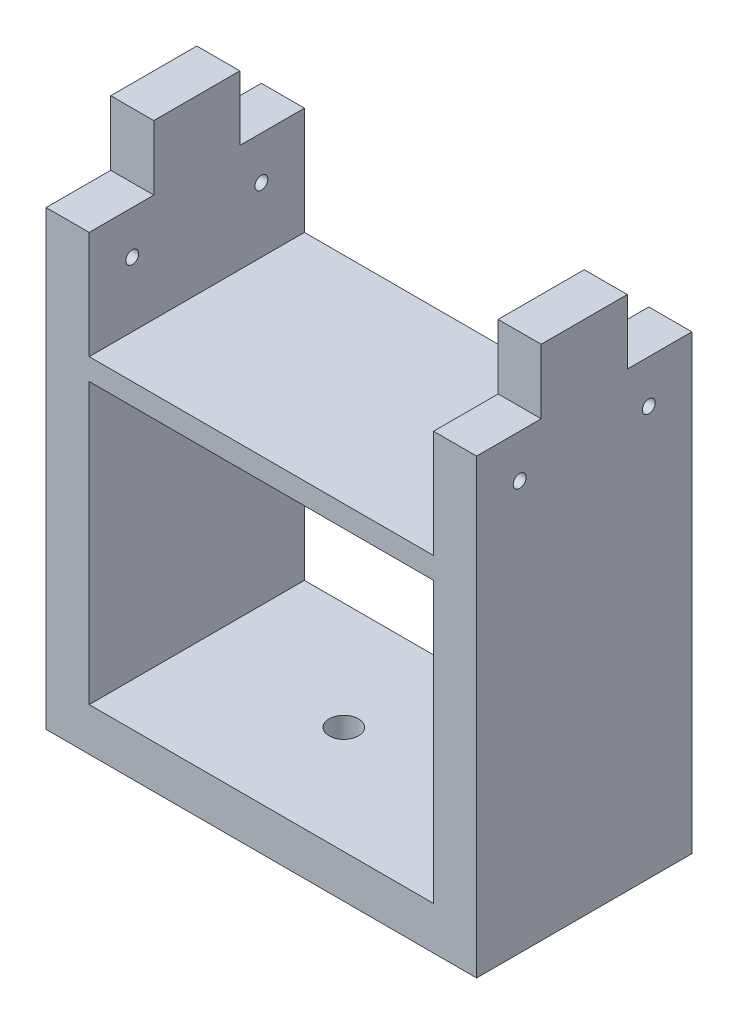
ISO-10303-21;
HEADER;
FILE_DESCRIPTION(('STEP AP214'),'2;1');
FILE_NAME('part.step','',(''),(''),'','','');
FILE_SCHEMA(('AUTOMOTIVE_DESIGN { 1 0 10303 214 1 1 1 1 }'));
ENDSEC;
DATA;
#1=APPLICATION_CONTEXT('core data for automotive mechanical design processes');
#2=APPLICATION_PROTOCOL_DEFINITION('international standard','automotive_design',2000,#1);
#3=PRODUCT_CONTEXT('',#1,'mechanical');
#4=PRODUCT('Part','Part','',(#3));
#5=PRODUCT_RELATED_PRODUCT_CATEGORY('part','',(#4));
#6=PRODUCT_DEFINITION_FORMATION('','',#4);
#7=PRODUCT_DEFINITION_CONTEXT('part definition',#1,'design');
#8=PRODUCT_DEFINITION('design','',#6,#7);
#9=PRODUCT_DEFINITION_SHAPE('','',#8);
#10=(LENGTH_UNIT() NAMED_UNIT(*) SI_UNIT(.MILLI.,.METRE.));
#11=(NAMED_UNIT(*) PLANE_ANGLE_UNIT() SI_UNIT($,.RADIAN.));
#12=(NAMED_UNIT(*) SI_UNIT($,.STERADIAN.) SOLID_ANGLE_UNIT());
#13=UNCERTAINTY_MEASURE_WITH_UNIT(LENGTH_MEASURE(1.E-05),#10,'distance_accuracy_value','');
#14=(GEOMETRIC_REPRESENTATION_CONTEXT(3) GLOBAL_UNCERTAINTY_ASSIGNED_CONTEXT((#13)) GLOBAL_UNIT_ASSIGNED_CONTEXT((#10,
#11,#12)) REPRESENTATION_CONTEXT('',''));
#15=CARTESIAN_POINT('',(0.,0.,0.));
#16=DIRECTION('',(0.,0.,1.));
#17=DIRECTION('',(1.,0.,0.));
#18=AXIS2_PLACEMENT_3D('',#15,#16,#17);
#19=CARTESIAN_POINT('',(50.0100000000001,105.,15.));
#20=DIRECTION('',(0.,1.,0.));
#21=DIRECTION('',(-1.,0.,0.));
#22=AXIS2_PLACEMENT_3D('',#19,#20,#21);
#23=PLANE('',#22);
#24=DIRECTION('',(0.,0.,-1.));
#25=VECTOR('',#24,1.);
#26=CARTESIAN_POINT('',(40.,105.,50.));
#27=LINE('',#26,#25);
#28=CARTESIAN_POINT('',(40.,105.,15.));
#29=VERTEX_POINT('',#28);
#30=CARTESIAN_POINT('',(40.,105.,0.));
#31=VERTEX_POINT('',#30);
#32=EDGE_CURVE('E364',#29,#31,#27,.T.);
#33=ORIENTED_EDGE('',*,*,#32,.F.);
#34=DIRECTION('',(-1.,0.,0.));
#35=VECTOR('',#34,1.);
#36=CARTESIAN_POINT('',(50.0100000000001,105.,15.));
#37=LINE('',#36,#35);
#38=CARTESIAN_POINT('',(50.,105.,15.));
#39=VERTEX_POINT('',#38);
#40=EDGE_CURVE('E53',#39,#29,#37,.T.);
#41=ORIENTED_EDGE('',*,*,#40,.F.);
#42=DIRECTION('',(0.,0.,-1.));
#43=VECTOR('',#42,1.);
#44=CARTESIAN_POINT('',(50.,105.,50.));
#45=LINE('',#44,#43);
#46=CARTESIAN_POINT('',(50.,105.,0.));
#47=VERTEX_POINT('',#46);
#48=EDGE_CURVE('E218',#39,#47,#45,.T.);
#49=ORIENTED_EDGE('',*,*,#48,.T.);
#50=DIRECTION('',(-1.,0.,0.));
#51=VECTOR('',#50,1.);
#52=CARTESIAN_POINT('',(0.,105.,0.));
#53=LINE('',#52,#51);
#54=EDGE_CURVE('E214',#47,#31,#53,.T.);
#55=ORIENTED_EDGE('',*,*,#54,.T.);
#56=EDGE_LOOP('',(#33,#41,#49,#55));
#57=FACE_BOUND('',#56,.T.);
#58=ADVANCED_FACE('F43',(#57),#23,.T.);
#59=CARTESIAN_POINT('',(50.0100000000001,120.,15.));
#60=DIRECTION('',(0.,0.,-1.));
#61=DIRECTION('',(0.,1.,0.));
#62=AXIS2_PLACEMENT_3D('',#59,#60,#61);
#63=PLANE('',#62);
#64=DIRECTION('',(0.,-1.,0.));
#65=VECTOR('',#64,1.);
#66=CARTESIAN_POINT('',(40.,10.,15.));
#67=LINE('',#66,#65);
#68=CARTESIAN_POINT('',(40.,120.,15.));
#69=VERTEX_POINT('',#68);
#70=EDGE_CURVE('E368',#69,#29,#67,.T.);
#71=ORIENTED_EDGE('',*,*,#70,.F.);
#72=DIRECTION('',(-1.,0.,0.));
#73=VECTOR('',#72,1.);
#74=CARTESIAN_POINT('',(50.0100000000001,120.,15.));
#75=LINE('',#74,#73);
#76=CARTESIAN_POINT('',(50.,120.,15.));
#77=VERTEX_POINT('',#76);
#78=EDGE_CURVE('E351',#77,#69,#75,.T.);
#79=ORIENTED_EDGE('',*,*,#78,.F.);
#80=DIRECTION('',(0.,-1.,0.));
#81=VECTOR('',#80,1.);
#82=CARTESIAN_POINT('',(50.,0.,15.));
#83=LINE('',#82,#81);
#84=EDGE_CURVE('E426',#77,#39,#83,.T.);
#85=ORIENTED_EDGE('',*,*,#84,.T.);
#86=ORIENTED_EDGE('',*,*,#40,.T.);
#87=EDGE_LOOP('',(#71,#79,#85,#86));
#88=FACE_BOUND('',#87,.T.);
#89=ADVANCED_FACE('F443',(#88),#63,.T.);
#90=CARTESIAN_POINT('',(50.0100000000001,120.,35.));
#91=DIRECTION('',(0.,1.,0.));
#92=DIRECTION('',(-1.,0.,0.));
#93=AXIS2_PLACEMENT_3D('',#90,#91,#92);
#94=PLANE('',#93);
#95=DIRECTION('',(0.,0.,-1.));
#96=VECTOR('',#95,1.);
#97=CARTESIAN_POINT('',(40.,120.,50.));
#98=LINE('',#97,#96);
#99=CARTESIAN_POINT('',(40.,120.,35.));
#100=VERTEX_POINT('',#99);
#101=EDGE_CURVE('E372',#100,#69,#98,.T.);
#102=ORIENTED_EDGE('',*,*,#101,.F.);
#103=DIRECTION('',(-1.,0.,0.));
#104=VECTOR('',#103,1.);
#105=CARTESIAN_POINT('',(50.0100000000001,120.,35.));
#106=LINE('',#105,#104);
#107=CARTESIAN_POINT('',(50.,120.,35.));
#108=VERTEX_POINT('',#107);
#109=EDGE_CURVE('E355',#108,#100,#106,.T.);
#110=ORIENTED_EDGE('',*,*,#109,.F.);
#111=DIRECTION('',(0.,0.,-1.));
#112=VECTOR('',#111,1.);
#113=CARTESIAN_POINT('',(50.,120.,50.));
#114=LINE('',#113,#112);
#115=EDGE_CURVE('E423',#108,#77,#114,.T.);
#116=ORIENTED_EDGE('',*,*,#115,.T.);
#117=ORIENTED_EDGE('',*,*,#78,.T.);
#118=EDGE_LOOP('',(#102,#110,#116,#117));
#119=FACE_BOUND('',#118,.T.);
#120=ADVANCED_FACE('F502',(#119),#94,.T.);
#121=CARTESIAN_POINT('',(50.0100000000001,105.,50.));
#122=DIRECTION('',(0.,1.,0.));
#123=DIRECTION('',(0.,0.,1.));
#124=AXIS2_PLACEMENT_3D('',#121,#122,#123);
#125=PLANE('',#124);
#126=DIRECTION('',(0.,0.,-1.));
#127=VECTOR('',#126,1.);
#128=CARTESIAN_POINT('',(40.,105.,49.9999999999999));
#129=LINE('',#128,#127);
#130=CARTESIAN_POINT('',(40.,105.,50.));
#131=VERTEX_POINT('',#130);
#132=CARTESIAN_POINT('',(40.,105.,35.));
#133=VERTEX_POINT('',#132);
#134=EDGE_CURVE('E205',#131,#133,#129,.T.);
#135=ORIENTED_EDGE('',*,*,#134,.F.);
#136=DIRECTION('',(-1.,0.,0.));
#137=VECTOR('',#136,1.);
#138=CARTESIAN_POINT('',(0.,105.,50.));
#139=LINE('',#138,#137);
#140=CARTESIAN_POINT('',(50.,105.,50.));
#141=VERTEX_POINT('',#140);
#142=EDGE_CURVE('E363',#141,#131,#139,.T.);
#143=ORIENTED_EDGE('',*,*,#142,.F.);
#144=DIRECTION('',(0.,0.,-1.));
#145=VECTOR('',#144,1.);
#146=CARTESIAN_POINT('',(50.,105.,49.9999999999999));
#147=LINE('',#146,#145);
#148=CARTESIAN_POINT('',(50.,105.,35.));
#149=VERTEX_POINT('',#148);
#150=EDGE_CURVE('E415',#141,#149,#147,.T.);
#151=ORIENTED_EDGE('',*,*,#150,.T.);
#152=DIRECTION('',(-1.,0.,0.));
#153=VECTOR('',#152,1.);
#154=CARTESIAN_POINT('',(50.0100000000001,105.,35.));
#155=LINE('',#154,#153);
#156=EDGE_CURVE('E344',#149,#133,#155,.T.);
#157=ORIENTED_EDGE('',*,*,#156,.T.);
#158=EDGE_LOOP('',(#135,#143,#151,#157));
#159=FACE_BOUND('',#158,.T.);
#160=ADVANCED_FACE('F495',(#159),#125,.T.);
#161=CARTESIAN_POINT('',(50.0100000000001,105.,35.));
#162=DIRECTION('',(0.,0.,1.));
#163=DIRECTION('',(1.,0.,0.));
#164=AXIS2_PLACEMENT_3D('',#161,#162,#163);
#165=PLANE('',#164);
#166=DIRECTION('',(0.,1.,0.));
#167=VECTOR('',#166,1.);
#168=CARTESIAN_POINT('',(40.,10.,35.));
#169=LINE('',#168,#167);
#170=EDGE_CURVE('E376',#133,#100,#169,.T.);
#171=ORIENTED_EDGE('',*,*,#170,.F.);
#172=ORIENTED_EDGE('',*,*,#156,.F.);
#173=DIRECTION('',(0.,1.,0.));
#174=VECTOR('',#173,1.);
#175=CARTESIAN_POINT('',(50.,0.,35.));
#176=LINE('',#175,#174);
#177=EDGE_CURVE('E419',#149,#108,#176,.T.);
#178=ORIENTED_EDGE('',*,*,#177,.T.);
#179=ORIENTED_EDGE('',*,*,#109,.T.);
#180=EDGE_LOOP('',(#171,#172,#178,#179));
#181=FACE_BOUND('',#180,.T.);
#182=ADVANCED_FACE('F499',(#181),#165,.T.);
#183=DIRECTION('',(0.,0.,1.));
#184=VECTOR('',#183,1.);
#185=CARTESIAN_POINT('',(-40.,105.,50.));
#186=LINE('',#185,#184);
#187=CARTESIAN_POINT('',(-40.,105.,0.));
#188=VERTEX_POINT('',#187);
#189=CARTESIAN_POINT('',(-40.,105.,15.));
#190=VERTEX_POINT('',#189);
#191=EDGE_CURVE('E188',#188,#190,#186,.T.);
#192=ORIENTED_EDGE('',*,*,#191,.F.);
#193=CARTESIAN_POINT('',(-50.,105.,0.));
#194=VERTEX_POINT('',#193);
#195=EDGE_CURVE('E203',#188,#194,#53,.T.);
#196=ORIENTED_EDGE('',*,*,#195,.T.);
#197=DIRECTION('',(0.,0.,1.));
#198=VECTOR('',#197,1.);
#199=CARTESIAN_POINT('',(-50.,105.,50.));
#200=LINE('',#199,#198);
#201=CARTESIAN_POINT('',(-50.,105.,15.));
#202=VERTEX_POINT('',#201);
#203=EDGE_CURVE('E412',#194,#202,#200,.T.);
#204=ORIENTED_EDGE('',*,*,#203,.T.);
#205=EDGE_CURVE('E11',#190,#202,#37,.T.);
#206=ORIENTED_EDGE('',*,*,#205,.F.);
#207=EDGE_LOOP('',(#192,#196,#204,#206));
#208=FACE_BOUND('',#207,.T.);
#209=ADVANCED_FACE('F201',(#208),#23,.T.);
#210=DIRECTION('',(0.,1.,0.));
#211=VECTOR('',#210,1.);
#212=CARTESIAN_POINT('',(-40.,216.619003688227,15.));
#213=LINE('',#212,#211);
#214=CARTESIAN_POINT('',(-40.,120.,15.));
#215=VERTEX_POINT('',#214);
#216=EDGE_CURVE('E206',#190,#215,#213,.T.);
#217=ORIENTED_EDGE('',*,*,#216,.F.);
#218=ORIENTED_EDGE('',*,*,#205,.T.);
#219=DIRECTION('',(0.,1.,0.));
#220=VECTOR('',#219,1.);
#221=CARTESIAN_POINT('',(-50.,225.01,15.));
#222=LINE('',#221,#220);
#223=CARTESIAN_POINT('',(-50.,120.,15.));
#224=VERTEX_POINT('',#223);
#225=EDGE_CURVE('E408',#202,#224,#222,.T.);
#226=ORIENTED_EDGE('',*,*,#225,.T.);
#227=EDGE_CURVE('E348',#215,#224,#75,.T.);
#228=ORIENTED_EDGE('',*,*,#227,.F.);
#229=EDGE_LOOP('',(#217,#218,#226,#228));
#230=FACE_BOUND('',#229,.T.);
#231=ADVANCED_FACE('F478',(#230),#63,.T.);
#232=DIRECTION('',(0.,0.,1.));
#233=VECTOR('',#232,1.);
#234=CARTESIAN_POINT('',(-40.,120.,50.));
#235=LINE('',#234,#233);
#236=CARTESIAN_POINT('',(-40.,120.,35.));
#237=VERTEX_POINT('',#236);
#238=EDGE_CURVE('E385',#215,#237,#235,.T.);
#239=ORIENTED_EDGE('',*,*,#238,.F.);
#240=ORIENTED_EDGE('',*,*,#227,.T.);
#241=DIRECTION('',(0.,0.,1.));
#242=VECTOR('',#241,1.);
#243=CARTESIAN_POINT('',(-50.,120.,50.));
#244=LINE('',#243,#242);
#245=CARTESIAN_POINT('',(-50.,120.,35.));
#246=VERTEX_POINT('',#245);
#247=EDGE_CURVE('E404',#224,#246,#244,.T.);
#248=ORIENTED_EDGE('',*,*,#247,.T.);
#249=EDGE_CURVE('E352',#237,#246,#106,.T.);
#250=ORIENTED_EDGE('',*,*,#249,.F.);
#251=EDGE_LOOP('',(#239,#240,#248,#250));
#252=FACE_BOUND('',#251,.T.);
#253=ADVANCED_FACE('F482',(#252),#94,.T.);
#254=DIRECTION('',(0.,0.,1.));
#255=VECTOR('',#254,1.);
#256=CARTESIAN_POINT('',(-40.,105.,50.0000000000001));
#257=LINE('',#256,#255);
#258=CARTESIAN_POINT('',(-40.,105.,35.));
#259=VERTEX_POINT('',#258);
#260=CARTESIAN_POINT('',(-40.,105.,50.));
#261=VERTEX_POINT('',#260);
#262=EDGE_CURVE('E392',#259,#261,#257,.T.);
#263=ORIENTED_EDGE('',*,*,#262,.F.);
#264=CARTESIAN_POINT('',(-50.,105.,35.));
#265=VERTEX_POINT('',#264);
#266=EDGE_CURVE('E356',#259,#265,#155,.T.);
#267=ORIENTED_EDGE('',*,*,#266,.T.);
#268=DIRECTION('',(0.,0.,1.));
#269=VECTOR('',#268,1.);
#270=CARTESIAN_POINT('',(-50.,105.,50.0000000000001));
#271=LINE('',#270,#269);
#272=CARTESIAN_POINT('',(-50.,105.,50.));
#273=VERTEX_POINT('',#272);
#274=EDGE_CURVE('E396',#265,#273,#271,.T.);
#275=ORIENTED_EDGE('',*,*,#274,.T.);
#276=EDGE_CURVE('E359',#261,#273,#139,.T.);
#277=ORIENTED_EDGE('',*,*,#276,.F.);
#278=EDGE_LOOP('',(#263,#267,#275,#277));
#279=FACE_BOUND('',#278,.T.);
#280=ADVANCED_FACE('F488',(#279),#125,.T.);
#281=DIRECTION('',(0.,-1.,0.));
#282=VECTOR('',#281,1.);
#283=CARTESIAN_POINT('',(-40.,216.619003688227,35.));
#284=LINE('',#283,#282);
#285=EDGE_CURVE('E389',#237,#259,#284,.T.);
#286=ORIENTED_EDGE('',*,*,#285,.F.);
#287=ORIENTED_EDGE('',*,*,#249,.T.);
#288=DIRECTION('',(0.,-1.,0.));
#289=VECTOR('',#288,1.);
#290=CARTESIAN_POINT('',(-50.,225.01,35.));
#291=LINE('',#290,#289);
#292=EDGE_CURVE('E400',#246,#265,#291,.T.);
#293=ORIENTED_EDGE('',*,*,#292,.T.);
#294=ORIENTED_EDGE('',*,*,#266,.F.);
#295=EDGE_LOOP('',(#286,#287,#293,#294));
#296=FACE_BOUND('',#295,.T.);
#297=ADVANCED_FACE('F484',(#296),#165,.T.);
#298=CARTESIAN_POINT('',(-40.,216.619003688227,50.));
#299=DIRECTION('',(1.,0.,0.));
#300=DIRECTION('',(0.,1.,0.));
#301=AXIS2_PLACEMENT_3D('',#298,#299,#300);
#302=PLANE('',#301);
#303=CARTESIAN_POINT('',(-40.,95.,40.));
#304=DIRECTION('',(1.,0.,0.));
#305=DIRECTION('',(0.,1.,0.));
#306=AXIS2_PLACEMENT_3D('',#303,#304,#305);
#307=CIRCLE('',#306,1.5);
#308=CARTESIAN_POINT('',(-40.,96.5,40.));
#309=VERTEX_POINT('',#308);
#310=EDGE_CURVE('E311',#309,#309,#307,.T.);
#311=ORIENTED_EDGE('',*,*,#310,.F.);
#312=EDGE_LOOP('',(#311));
#313=FACE_BOUND('',#312,.T.);
#314=CARTESIAN_POINT('',(-40.,95.,10.));
#315=DIRECTION('',(1.,0.,0.));
#316=DIRECTION('',(0.,1.,0.));
#317=AXIS2_PLACEMENT_3D('',#314,#315,#316);
#318=CIRCLE('',#317,1.5);
#319=CARTESIAN_POINT('',(-40.,96.5,10.));
#320=VERTEX_POINT('',#319);
#321=EDGE_CURVE('E323',#320,#320,#318,.F.);
#322=ORIENTED_EDGE('',*,*,#321,.T.);
#323=EDGE_LOOP('',(#322));
#324=FACE_BOUND('',#323,.T.);
#325=ORIENTED_EDGE('',*,*,#285,.T.);
#326=ORIENTED_EDGE('',*,*,#262,.T.);
#327=DIRECTION('',(0.,-1.,0.));
#328=VECTOR('',#327,1.);
#329=CARTESIAN_POINT('',(-40.,216.619003688227,50.));
#330=LINE('',#329,#328);
#331=CARTESIAN_POINT('',(-40.,80.,50.));
#332=VERTEX_POINT('',#331);
#333=EDGE_CURVE('E242',#261,#332,#330,.T.);
#334=ORIENTED_EDGE('',*,*,#333,.T.);
#335=DIRECTION('',(0.,0.,1.));
#336=VECTOR('',#335,1.);
#337=CARTESIAN_POINT('',(-40.,80.,0.));
#338=LINE('',#337,#336);
#339=CARTESIAN_POINT('',(-40.,80.,0.));
#340=VERTEX_POINT('',#339);
#341=EDGE_CURVE('E191',#340,#332,#338,.T.);
#342=ORIENTED_EDGE('',*,*,#341,.F.);
#343=DIRECTION('',(0.,-1.,0.));
#344=VECTOR('',#343,1.);
#345=CARTESIAN_POINT('',(-40.,216.619003688227,0.));
#346=LINE('',#345,#344);
#347=EDGE_CURVE('E47',#188,#340,#346,.T.);
#348=ORIENTED_EDGE('',*,*,#347,.F.);
#349=ORIENTED_EDGE('',*,*,#191,.T.);
#350=ORIENTED_EDGE('',*,*,#216,.T.);
#351=ORIENTED_EDGE('',*,*,#238,.T.);
#352=EDGE_LOOP('',(#325,#326,#334,#342,#348,#349,#350,#351));
#353=FACE_BOUND('',#352,.T.);
#354=ADVANCED_FACE('F186',(#313,#324,#353),#302,.T.);
#355=CARTESIAN_POINT('',(40.,10.,50.));
#356=DIRECTION('',(-1.,0.,0.));
#357=DIRECTION('',(0.,0.,1.));
#358=AXIS2_PLACEMENT_3D('',#355,#356,#357);
#359=PLANE('',#358);
#360=CARTESIAN_POINT('',(40.,95.,40.));
#361=DIRECTION('',(-1.,0.,0.));
#362=DIRECTION('',(0.,0.,1.));
#363=AXIS2_PLACEMENT_3D('',#360,#361,#362);
#364=CIRCLE('',#363,1.5);
#365=CARTESIAN_POINT('',(40.,95.,41.5));
#366=VERTEX_POINT('',#365);
#367=EDGE_CURVE('E319',#366,#366,#364,.T.);
#368=ORIENTED_EDGE('',*,*,#367,.F.);
#369=EDGE_LOOP('',(#368));
#370=FACE_BOUND('',#369,.T.);
#371=CARTESIAN_POINT('',(40.,95.,10.));
#372=DIRECTION('',(-1.,0.,0.));
#373=DIRECTION('',(0.,0.,1.));
#374=AXIS2_PLACEMENT_3D('',#371,#372,#373);
#375=CIRCLE('',#374,1.5);
#376=CARTESIAN_POINT('',(40.,95.,11.5));
#377=VERTEX_POINT('',#376);
#378=EDGE_CURVE('E327',#377,#377,#375,.F.);
#379=ORIENTED_EDGE('',*,*,#378,.T.);
#380=EDGE_LOOP('',(#379));
#381=FACE_BOUND('',#380,.T.);
#382=DIRECTION('',(0.,1.,0.));
#383=VECTOR('',#382,1.);
#384=CARTESIAN_POINT('',(40.,10.,50.));
#385=LINE('',#384,#383);
#386=CARTESIAN_POINT('',(40.,80.,50.));
#387=VERTEX_POINT('',#386);
#388=EDGE_CURVE('E69',#387,#131,#385,.T.);
#389=ORIENTED_EDGE('',*,*,#388,.T.);
#390=ORIENTED_EDGE('',*,*,#134,.T.);
#391=ORIENTED_EDGE('',*,*,#170,.T.);
#392=ORIENTED_EDGE('',*,*,#101,.T.);
#393=ORIENTED_EDGE('',*,*,#70,.T.);
#394=ORIENTED_EDGE('',*,*,#32,.T.);
#395=DIRECTION('',(0.,1.,0.));
#396=VECTOR('',#395,1.);
#397=CARTESIAN_POINT('',(40.,10.,0.));
#398=LINE('',#397,#396);
#399=CARTESIAN_POINT('',(40.,80.,0.));
#400=VERTEX_POINT('',#399);
#401=EDGE_CURVE('E248',#400,#31,#398,.T.);
#402=ORIENTED_EDGE('',*,*,#401,.F.);
#403=DIRECTION('',(0.,0.,1.));
#404=VECTOR('',#403,1.);
#405=CARTESIAN_POINT('',(40.,80.,0.));
#406=LINE('',#405,#404);
#407=EDGE_CURVE('E299',#400,#387,#406,.T.);
#408=ORIENTED_EDGE('',*,*,#407,.T.);
#409=EDGE_LOOP('',(#389,#390,#391,#392,#393,#394,#402,#408));
#410=FACE_BOUND('',#409,.T.);
#411=ADVANCED_FACE('F440',(#370,#381,#410),#359,.T.);
#412=CARTESIAN_POINT('',(-50.,225.01,50.));
#413=DIRECTION('',(1.,0.,0.));
#414=DIRECTION('',(0.,1.,0.));
#415=AXIS2_PLACEMENT_3D('',#412,#413,#414);
#416=PLANE('',#415);
#417=CARTESIAN_POINT('',(-50.,95.,40.));
#418=DIRECTION('',(-1.,0.,0.));
#419=DIRECTION('',(0.,-1.,0.));
#420=AXIS2_PLACEMENT_3D('',#417,#418,#419);
#421=CIRCLE('',#420,1.5);
#422=CARTESIAN_POINT('',(-50.,93.5,40.));
#423=VERTEX_POINT('',#422);
#424=EDGE_CURVE('E336',#423,#423,#421,.T.);
#425=ORIENTED_EDGE('',*,*,#424,.F.);
#426=EDGE_LOOP('',(#425));
#427=FACE_BOUND('',#426,.T.);
#428=CARTESIAN_POINT('',(-50.,95.,10.));
#429=DIRECTION('',(1.,0.,0.));
#430=DIRECTION('',(0.,1.,0.));
#431=AXIS2_PLACEMENT_3D('',#428,#429,#430);
#432=CIRCLE('',#431,1.5);
#433=CARTESIAN_POINT('',(-50.,96.5,10.));
#434=VERTEX_POINT('',#433);
#435=EDGE_CURVE('E332',#434,#434,#432,.T.);
#436=ORIENTED_EDGE('',*,*,#435,.T.);
#437=EDGE_LOOP('',(#436));
#438=FACE_BOUND('',#437,.T.);
#439=ORIENTED_EDGE('',*,*,#274,.F.);
#440=ORIENTED_EDGE('',*,*,#292,.F.);
#441=ORIENTED_EDGE('',*,*,#247,.F.);
#442=ORIENTED_EDGE('',*,*,#225,.F.);
#443=ORIENTED_EDGE('',*,*,#203,.F.);
#444=DIRECTION('',(0.,-1.,0.));
#445=VECTOR('',#444,1.);
#446=CARTESIAN_POINT('',(-50.,225.01,0.));
#447=LINE('',#446,#445);
#448=CARTESIAN_POINT('',(-50.,0.,0.));
#449=VERTEX_POINT('',#448);
#450=EDGE_CURVE('E211',#194,#449,#447,.T.);
#451=ORIENTED_EDGE('',*,*,#450,.T.);
#452=DIRECTION('',(0.,0.,-1.));
#453=VECTOR('',#452,1.);
#454=CARTESIAN_POINT('',(-50.,0.,50.));
#455=LINE('',#454,#453);
#456=CARTESIAN_POINT('',(-50.,0.,50.));
#457=VERTEX_POINT('',#456);
#458=EDGE_CURVE('E362',#457,#449,#455,.T.);
#459=ORIENTED_EDGE('',*,*,#458,.F.);
#460=DIRECTION('',(0.,-1.,0.));
#461=VECTOR('',#460,1.);
#462=CARTESIAN_POINT('',(-50.,225.01,50.));
#463=LINE('',#462,#461);
#464=EDGE_CURVE('E228',#273,#457,#463,.T.);
#465=ORIENTED_EDGE('',*,*,#464,.F.);
#466=EDGE_LOOP('',(#439,#440,#441,#442,#443,#451,#459,#465));
#467=FACE_BOUND('',#466,.T.);
#468=ADVANCED_FACE('F473',(#427,#438,#467),#416,.F.);
#469=CARTESIAN_POINT('',(50.,0.,50.));
#470=DIRECTION('',(-1.,0.,0.));
#471=DIRECTION('',(0.,-1.,0.));
#472=AXIS2_PLACEMENT_3D('',#469,#470,#471);
#473=PLANE('',#472);
#474=CARTESIAN_POINT('',(50.,95.,40.));
#475=DIRECTION('',(-1.,0.,0.));
#476=DIRECTION('',(0.,-1.,0.));
#477=AXIS2_PLACEMENT_3D('',#474,#475,#476);
#478=CIRCLE('',#477,1.5);
#479=CARTESIAN_POINT('',(50.,93.5,40.));
#480=VERTEX_POINT('',#479);
#481=EDGE_CURVE('E340',#480,#480,#478,.T.);
#482=ORIENTED_EDGE('',*,*,#481,.T.);
#483=EDGE_LOOP('',(#482));
#484=FACE_BOUND('',#483,.T.);
#485=CARTESIAN_POINT('',(50.,95.,10.));
#486=DIRECTION('',(1.,0.,0.));
#487=DIRECTION('',(0.,1.,0.));
#488=AXIS2_PLACEMENT_3D('',#485,#486,#487);
#489=CIRCLE('',#488,1.5);
#490=CARTESIAN_POINT('',(50.,96.5,10.));
#491=VERTEX_POINT('',#490);
#492=EDGE_CURVE('E331',#491,#491,#489,.T.);
#493=ORIENTED_EDGE('',*,*,#492,.F.);
#494=EDGE_LOOP('',(#493));
#495=FACE_BOUND('',#494,.T.);
#496=ORIENTED_EDGE('',*,*,#150,.F.);
#497=DIRECTION('',(0.,1.,0.));
#498=VECTOR('',#497,1.);
#499=CARTESIAN_POINT('',(50.,0.,50.));
#500=LINE('',#499,#498);
#501=CARTESIAN_POINT('',(50.,0.,50.));
#502=VERTEX_POINT('',#501);
#503=EDGE_CURVE('E222',#502,#141,#500,.T.);
#504=ORIENTED_EDGE('',*,*,#503,.F.);
#505=DIRECTION('',(0.,0.,-1.));
#506=VECTOR('',#505,1.);
#507=CARTESIAN_POINT('',(50.,0.,50.));
#508=LINE('',#507,#506);
#509=CARTESIAN_POINT('',(50.,0.,0.));
#510=VERTEX_POINT('',#509);
#511=EDGE_CURVE('E227',#502,#510,#508,.T.);
#512=ORIENTED_EDGE('',*,*,#511,.T.);
#513=DIRECTION('',(0.,1.,0.));
#514=VECTOR('',#513,1.);
#515=CARTESIAN_POINT('',(50.,0.,0.));
#516=LINE('',#515,#514);
#517=EDGE_CURVE('E231',#510,#47,#516,.T.);
#518=ORIENTED_EDGE('',*,*,#517,.T.);
#519=ORIENTED_EDGE('',*,*,#48,.F.);
#520=ORIENTED_EDGE('',*,*,#84,.F.);
#521=ORIENTED_EDGE('',*,*,#115,.F.);
#522=ORIENTED_EDGE('',*,*,#177,.F.);
#523=EDGE_LOOP('',(#496,#504,#512,#518,#519,#520,#521,#522));
#524=FACE_BOUND('',#523,.T.);
#525=ADVANCED_FACE('F503',(#484,#495,#524),#473,.F.);
#526=CARTESIAN_POINT('',(0.,0.,50.));
#527=DIRECTION('',(0.,0.,1.));
#528=DIRECTION('',(1.,0.,0.));
#529=AXIS2_PLACEMENT_3D('',#526,#527,#528);
#530=PLANE('',#529);
#531=CARTESIAN_POINT('',(-40.,75.,50.));
#532=VERTEX_POINT('',#531);
#533=CARTESIAN_POINT('',(-40.,10.,50.));
#534=VERTEX_POINT('',#533);
#535=EDGE_CURVE('E61',#532,#534,#330,.T.);
#536=ORIENTED_EDGE('',*,*,#535,.F.);
#537=DIRECTION('',(1.,0.,0.));
#538=VECTOR('',#537,1.);
#539=CARTESIAN_POINT('',(-40.,75.,50.));
#540=LINE('',#539,#538);
#541=CARTESIAN_POINT('',(40.,75.,50.));
#542=VERTEX_POINT('',#541);
#543=EDGE_CURVE('E307',#532,#542,#540,.T.);
#544=ORIENTED_EDGE('',*,*,#543,.T.);
#545=CARTESIAN_POINT('',(40.,10.,50.));
#546=VERTEX_POINT('',#545);
#547=EDGE_CURVE('E238',#546,#542,#385,.T.);
#548=ORIENTED_EDGE('',*,*,#547,.F.);
#549=DIRECTION('',(1.,0.,0.));
#550=VECTOR('',#549,1.);
#551=CARTESIAN_POINT('',(-40.,10.,50.));
#552=LINE('',#551,#550);
#553=EDGE_CURVE('E244',#534,#546,#552,.T.);
#554=ORIENTED_EDGE('',*,*,#553,.F.);
#555=EDGE_LOOP('',(#536,#544,#548,#554));
#556=FACE_BOUND('',#555,.T.);
#557=ORIENTED_EDGE('',*,*,#503,.T.);
#558=ORIENTED_EDGE('',*,*,#142,.T.);
#559=ORIENTED_EDGE('',*,*,#388,.F.);
#560=DIRECTION('',(-1.,0.,0.));
#561=VECTOR('',#560,1.);
#562=CARTESIAN_POINT('',(40.,80.,50.));
#563=LINE('',#562,#561);
#564=EDGE_CURVE('E304',#387,#332,#563,.T.);
#565=ORIENTED_EDGE('',*,*,#564,.T.);
#566=ORIENTED_EDGE('',*,*,#333,.F.);
#567=ORIENTED_EDGE('',*,*,#276,.T.);
#568=ORIENTED_EDGE('',*,*,#464,.T.);
#569=DIRECTION('',(1.,0.,0.));
#570=VECTOR('',#569,1.);
#571=CARTESIAN_POINT('',(-50.,0.,50.));
#572=LINE('',#571,#570);
#573=EDGE_CURVE('E226',#457,#502,#572,.T.);
#574=ORIENTED_EDGE('',*,*,#573,.T.);
#575=EDGE_LOOP('',(#557,#558,#559,#565,#566,#567,#568,#574));
#576=FACE_BOUND('',#575,.T.);
#577=ADVANCED_FACE('F45',(#556,#576),#530,.T.);
#578=CARTESIAN_POINT('',(0.,0.,0.));
#579=DIRECTION('',(0.,0.,1.));
#580=DIRECTION('',(1.,0.,0.));
#581=AXIS2_PLACEMENT_3D('',#578,#579,#580);
#582=PLANE('',#581);
#583=DIRECTION('',(1.,0.,0.));
#584=VECTOR('',#583,1.);
#585=CARTESIAN_POINT('',(-40.,75.,0.));
#586=LINE('',#585,#584);
#587=CARTESIAN_POINT('',(-40.,75.,0.));
#588=VERTEX_POINT('',#587);
#589=CARTESIAN_POINT('',(40.,75.,0.));
#590=VERTEX_POINT('',#589);
#591=EDGE_CURVE('E308',#588,#590,#586,.T.);
#592=ORIENTED_EDGE('',*,*,#591,.F.);
#593=CARTESIAN_POINT('',(-40.,10.,0.));
#594=VERTEX_POINT('',#593);
#595=EDGE_CURVE('E197',#588,#594,#346,.T.);
#596=ORIENTED_EDGE('',*,*,#595,.T.);
#597=DIRECTION('',(1.,0.,0.));
#598=VECTOR('',#597,1.);
#599=CARTESIAN_POINT('',(-40.,10.,0.));
#600=LINE('',#599,#598);
#601=CARTESIAN_POINT('',(40.,10.,0.));
#602=VERTEX_POINT('',#601);
#603=EDGE_CURVE('E198',#594,#602,#600,.T.);
#604=ORIENTED_EDGE('',*,*,#603,.T.);
#605=EDGE_CURVE('E245',#602,#590,#398,.T.);
#606=ORIENTED_EDGE('',*,*,#605,.T.);
#607=EDGE_LOOP('',(#592,#596,#604,#606));
#608=FACE_BOUND('',#607,.T.);
#609=ORIENTED_EDGE('',*,*,#54,.F.);
#610=ORIENTED_EDGE('',*,*,#517,.F.);
#611=DIRECTION('',(1.,0.,0.));
#612=VECTOR('',#611,1.);
#613=CARTESIAN_POINT('',(-50.,0.,0.));
#614=LINE('',#613,#612);
#615=EDGE_CURVE('E234',#449,#510,#614,.T.);
#616=ORIENTED_EDGE('',*,*,#615,.F.);
#617=ORIENTED_EDGE('',*,*,#450,.F.);
#618=ORIENTED_EDGE('',*,*,#195,.F.);
#619=ORIENTED_EDGE('',*,*,#347,.T.);
#620=DIRECTION('',(-1.,0.,0.));
#621=VECTOR('',#620,1.);
#622=CARTESIAN_POINT('',(40.,80.,0.));
#623=LINE('',#622,#621);
#624=EDGE_CURVE('E294',#400,#340,#623,.T.);
#625=ORIENTED_EDGE('',*,*,#624,.F.);
#626=ORIENTED_EDGE('',*,*,#401,.T.);
#627=EDGE_LOOP('',(#609,#610,#616,#617,#618,#619,#625,#626));
#628=FACE_BOUND('',#627,.T.);
#629=ADVANCED_FACE('F209',(#608,#628),#582,.F.);
#630=CARTESIAN_POINT('',(-50.,0.,50.));
#631=DIRECTION('',(0.,1.,0.));
#632=DIRECTION('',(0.,0.,1.));
#633=AXIS2_PLACEMENT_3D('',#630,#631,#632);
#634=PLANE('',#633);
#635=CARTESIAN_POINT('',(-5.85128713251137,0.,25.));
#636=DIRECTION('',(0.,1.,0.));
#637=DIRECTION('',(-1.,0.,0.));
#638=AXIS2_PLACEMENT_3D('',#635,#636,#637);
#639=CIRCLE('',#638,3.425);
#640=CARTESIAN_POINT('',(-9.27628713251137,0.,25.));
#641=VERTEX_POINT('',#640);
#642=EDGE_CURVE('E288',#641,#641,#639,.T.);
#643=ORIENTED_EDGE('',*,*,#642,.T.);
#644=EDGE_LOOP('',(#643));
#645=FACE_BOUND('',#644,.T.);
#646=CARTESIAN_POINT('',(24.130974017595,0.,25.));
#647=DIRECTION('',(0.,1.,0.));
#648=DIRECTION('',(-1.,0.,0.));
#649=AXIS2_PLACEMENT_3D('',#646,#647,#648);
#650=CIRCLE('',#649,3.425);
#651=CARTESIAN_POINT('',(20.705974017595,0.,25.));
#652=VERTEX_POINT('',#651);
#653=EDGE_CURVE('E276',#652,#652,#650,.T.);
#654=ORIENTED_EDGE('',*,*,#653,.T.);
#655=EDGE_LOOP('',(#654));
#656=FACE_BOUND('',#655,.T.);
#657=ORIENTED_EDGE('',*,*,#615,.T.);
#658=ORIENTED_EDGE('',*,*,#511,.F.);
#659=ORIENTED_EDGE('',*,*,#573,.F.);
#660=ORIENTED_EDGE('',*,*,#458,.T.);
#661=EDGE_LOOP('',(#657,#658,#659,#660));
#662=FACE_BOUND('',#661,.T.);
#663=ADVANCED_FACE('F468',(#645,#656,#662),#634,.F.);
#664=DIRECTION('',(0.,0.,1.));
#665=VECTOR('',#664,1.);
#666=CARTESIAN_POINT('',(-40.,75.,0.));
#667=LINE('',#666,#665);
#668=EDGE_CURVE('E262',#588,#532,#667,.T.);
#669=ORIENTED_EDGE('',*,*,#668,.T.);
#670=ORIENTED_EDGE('',*,*,#535,.T.);
#671=DIRECTION('',(0.,0.,-1.));
#672=VECTOR('',#671,1.);
#673=CARTESIAN_POINT('',(-40.,10.,50.));
#674=LINE('',#673,#672);
#675=EDGE_CURVE('E237',#534,#594,#674,.T.);
#676=ORIENTED_EDGE('',*,*,#675,.T.);
#677=ORIENTED_EDGE('',*,*,#595,.F.);
#678=EDGE_LOOP('',(#669,#670,#676,#677));
#679=FACE_BOUND('',#678,.T.);
#680=ADVANCED_FACE('F259',(#679),#302,.T.);
#681=CARTESIAN_POINT('',(-40.,10.,50.));
#682=DIRECTION('',(0.,1.,0.));
#683=DIRECTION('',(-1.,0.,0.));
#684=AXIS2_PLACEMENT_3D('',#681,#682,#683);
#685=PLANE('',#684);
#686=CARTESIAN_POINT('',(-5.85128713251138,10.,25.));
#687=DIRECTION('',(0.,1.,0.));
#688=DIRECTION('',(-1.,0.,0.));
#689=AXIS2_PLACEMENT_3D('',#686,#687,#688);
#690=CIRCLE('',#689,3.425);
#691=CARTESIAN_POINT('',(-9.27628713251138,10.,25.));
#692=VERTEX_POINT('',#691);
#693=EDGE_CURVE('E284',#692,#692,#690,.T.);
#694=ORIENTED_EDGE('',*,*,#693,.F.);
#695=EDGE_LOOP('',(#694));
#696=FACE_BOUND('',#695,.T.);
#697=CARTESIAN_POINT('',(24.130974017595,10.,25.));
#698=DIRECTION('',(0.,1.,0.));
#699=DIRECTION('',(-1.,0.,0.));
#700=AXIS2_PLACEMENT_3D('',#697,#698,#699);
#701=CIRCLE('',#700,3.425);
#702=CARTESIAN_POINT('',(20.705974017595,10.,25.));
#703=VERTEX_POINT('',#702);
#704=EDGE_CURVE('E280',#703,#703,#701,.T.);
#705=ORIENTED_EDGE('',*,*,#704,.F.);
#706=EDGE_LOOP('',(#705));
#707=FACE_BOUND('',#706,.T.);
#708=ORIENTED_EDGE('',*,*,#603,.F.);
#709=ORIENTED_EDGE('',*,*,#675,.F.);
#710=ORIENTED_EDGE('',*,*,#553,.T.);
#711=DIRECTION('',(0.,0.,-1.));
#712=VECTOR('',#711,1.);
#713=CARTESIAN_POINT('',(40.,10.,50.));
#714=LINE('',#713,#712);
#715=EDGE_CURVE('E241',#546,#602,#714,.T.);
#716=ORIENTED_EDGE('',*,*,#715,.T.);
#717=EDGE_LOOP('',(#708,#709,#710,#716));
#718=FACE_BOUND('',#717,.T.);
#719=ADVANCED_FACE('F265',(#696,#707,#718),#685,.T.);
#720=DIRECTION('',(0.,0.,1.));
#721=VECTOR('',#720,1.);
#722=CARTESIAN_POINT('',(40.,75.,0.));
#723=LINE('',#722,#721);
#724=EDGE_CURVE('E295',#590,#542,#723,.T.);
#725=ORIENTED_EDGE('',*,*,#724,.F.);
#726=ORIENTED_EDGE('',*,*,#605,.F.);
#727=ORIENTED_EDGE('',*,*,#715,.F.);
#728=ORIENTED_EDGE('',*,*,#547,.T.);
#729=EDGE_LOOP('',(#725,#726,#727,#728));
#730=FACE_BOUND('',#729,.T.);
#731=ADVANCED_FACE('F453',(#730),#359,.T.);
#732=CARTESIAN_POINT('',(24.130974017595,0.,25.));
#733=DIRECTION('',(0.,1.,0.));
#734=DIRECTION('',(-1.,0.,0.));
#735=AXIS2_PLACEMENT_3D('',#732,#733,#734);
#736=CYLINDRICAL_SURFACE('',#735,3.425);
#737=ORIENTED_EDGE('',*,*,#653,.F.);
#738=EDGE_LOOP('',(#737));
#739=FACE_BOUND('',#738,.T.);
#740=ORIENTED_EDGE('',*,*,#704,.T.);
#741=EDGE_LOOP('',(#740));
#742=FACE_BOUND('',#741,.T.);
#743=ADVANCED_FACE('F542',(#739,#742),#736,.F.);
#744=CARTESIAN_POINT('',(-5.85128713251137,0.,25.));
#745=DIRECTION('',(0.,1.,0.));
#746=DIRECTION('',(-1.,0.,0.));
#747=AXIS2_PLACEMENT_3D('',#744,#745,#746);
#748=CYLINDRICAL_SURFACE('',#747,3.425);
#749=ORIENTED_EDGE('',*,*,#642,.F.);
#750=EDGE_LOOP('',(#749));
#751=FACE_BOUND('',#750,.T.);
#752=ORIENTED_EDGE('',*,*,#693,.T.);
#753=EDGE_LOOP('',(#752));
#754=FACE_BOUND('',#753,.T.);
#755=ADVANCED_FACE('F545',(#751,#754),#748,.F.);
#756=CARTESIAN_POINT('',(40.,80.,0.));
#757=DIRECTION('',(0.,1.,0.));
#758=DIRECTION('',(-1.,0.,0.));
#759=AXIS2_PLACEMENT_3D('',#756,#757,#758);
#760=PLANE('',#759);
#761=ORIENTED_EDGE('',*,*,#564,.F.);
#762=ORIENTED_EDGE('',*,*,#407,.F.);
#763=ORIENTED_EDGE('',*,*,#624,.T.);
#764=ORIENTED_EDGE('',*,*,#341,.T.);
#765=EDGE_LOOP('',(#761,#762,#763,#764));
#766=FACE_BOUND('',#765,.T.);
#767=ADVANCED_FACE('F491',(#766),#760,.T.);
#768=CARTESIAN_POINT('',(-40.,75.,0.));
#769=DIRECTION('',(0.,-1.,0.));
#770=DIRECTION('',(0.,0.,-1.));
#771=AXIS2_PLACEMENT_3D('',#768,#769,#770);
#772=PLANE('',#771);
#773=ORIENTED_EDGE('',*,*,#543,.F.);
#774=ORIENTED_EDGE('',*,*,#668,.F.);
#775=ORIENTED_EDGE('',*,*,#591,.T.);
#776=ORIENTED_EDGE('',*,*,#724,.T.);
#777=EDGE_LOOP('',(#773,#774,#775,#776));
#778=FACE_BOUND('',#777,.T.);
#779=ADVANCED_FACE('F451',(#778),#772,.T.);
#780=CARTESIAN_POINT('',(50.,95.,10.));
#781=DIRECTION('',(-1.,0.,0.));
#782=DIRECTION('',(0.,-1.,0.));
#783=AXIS2_PLACEMENT_3D('',#780,#781,#782);
#784=CYLINDRICAL_SURFACE('',#783,1.5);
#785=ORIENTED_EDGE('',*,*,#378,.F.);
#786=EDGE_LOOP('',(#785));
#787=FACE_BOUND('',#786,.T.);
#788=ORIENTED_EDGE('',*,*,#492,.T.);
#789=EDGE_LOOP('',(#788));
#790=FACE_BOUND('',#789,.T.);
#791=ADVANCED_FACE('F552',(#787,#790),#784,.F.);
#792=CARTESIAN_POINT('',(50.,95.,40.));
#793=DIRECTION('',(-1.,0.,0.));
#794=DIRECTION('',(0.,-1.,0.));
#795=AXIS2_PLACEMENT_3D('',#792,#793,#794);
#796=CYLINDRICAL_SURFACE('',#795,1.5);
#797=ORIENTED_EDGE('',*,*,#367,.T.);
#798=EDGE_LOOP('',(#797));
#799=FACE_BOUND('',#798,.T.);
#800=ORIENTED_EDGE('',*,*,#481,.F.);
#801=EDGE_LOOP('',(#800));
#802=FACE_BOUND('',#801,.T.);
#803=ADVANCED_FACE('F557',(#799,#802),#796,.F.);
#804=ORIENTED_EDGE('',*,*,#321,.F.);
#805=EDGE_LOOP('',(#804));
#806=FACE_BOUND('',#805,.T.);
#807=ORIENTED_EDGE('',*,*,#435,.F.);
#808=EDGE_LOOP('',(#807));
#809=FACE_BOUND('',#808,.T.);
#810=ADVANCED_FACE('F559',(#806,#809),#784,.F.);
#811=ORIENTED_EDGE('',*,*,#310,.T.);
#812=EDGE_LOOP('',(#811));
#813=FACE_BOUND('',#812,.T.);
#814=ORIENTED_EDGE('',*,*,#424,.T.);
#815=EDGE_LOOP('',(#814));
#816=FACE_BOUND('',#815,.T.);
#817=ADVANCED_FACE('F563',(#813,#816),#796,.F.);
#818=CLOSED_SHELL('',(#58,#89,#120,#160,#182,#209,#231,#253,#280,#297,#354,#411,#468,#525,#577,
#629,#663,#680,#719,#731,#743,#755,#767,#779,#791,#803,#810,#817));
#819=MANIFOLD_SOLID_BREP('B2',#818);
#820=ADVANCED_BREP_SHAPE_REPRESENTATION('',(#18,#819),#14);
#821=SHAPE_DEFINITION_REPRESENTATION(#9,#820);
ENDSEC;
END-ISO-10303-21;
